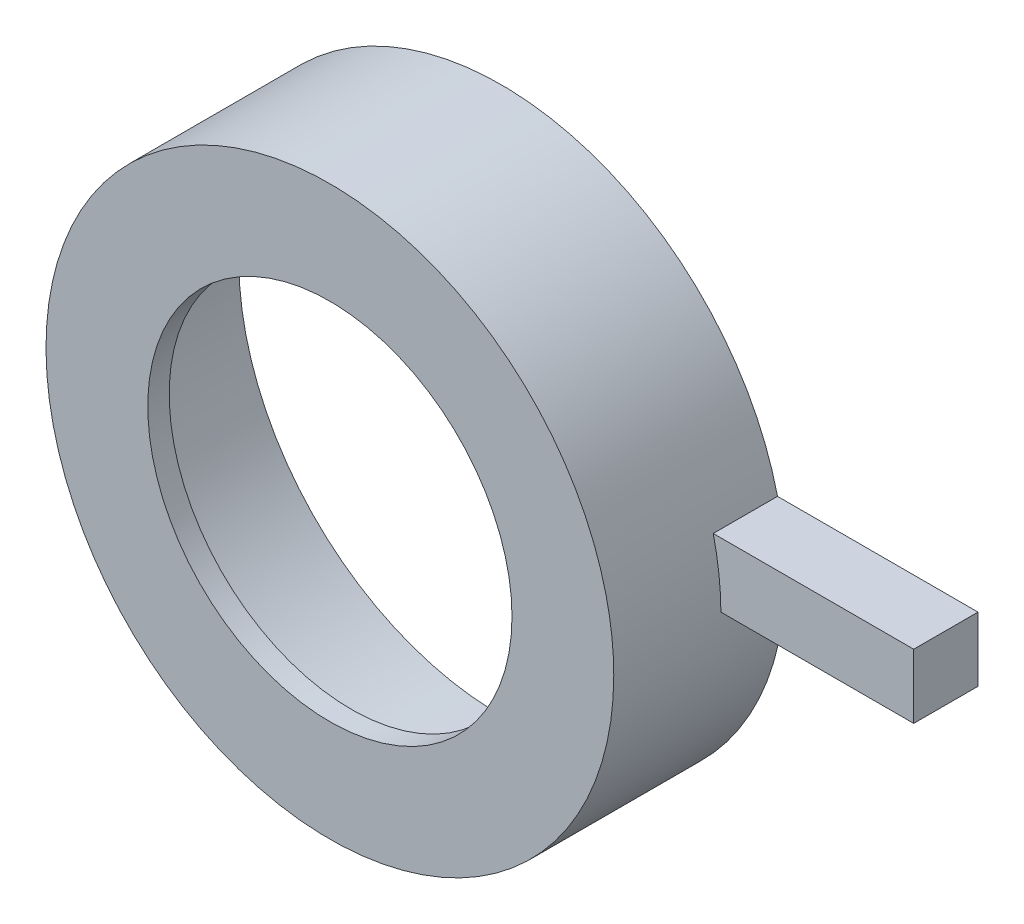
ISO-10303-21;
HEADER;
FILE_DESCRIPTION(('STEP AP214'),'2;1');
FILE_NAME('part.step','',(''),(''),'','','');
FILE_SCHEMA(('AUTOMOTIVE_DESIGN { 1 0 10303 214 1 1 1 1 }'));
ENDSEC;
DATA;
#1=APPLICATION_CONTEXT('core data for automotive mechanical design processes');
#2=APPLICATION_PROTOCOL_DEFINITION('international standard','automotive_design',2000,#1);
#3=PRODUCT_CONTEXT('',#1,'mechanical');
#4=PRODUCT('Part','Part','',(#3));
#5=PRODUCT_RELATED_PRODUCT_CATEGORY('part','',(#4));
#6=PRODUCT_DEFINITION_FORMATION('','',#4);
#7=PRODUCT_DEFINITION_CONTEXT('part definition',#1,'design');
#8=PRODUCT_DEFINITION('design','',#6,#7);
#9=PRODUCT_DEFINITION_SHAPE('','',#8);
#10=(LENGTH_UNIT() NAMED_UNIT(*) SI_UNIT(.MILLI.,.METRE.));
#11=(NAMED_UNIT(*) PLANE_ANGLE_UNIT() SI_UNIT($,.RADIAN.));
#12=(NAMED_UNIT(*) SI_UNIT($,.STERADIAN.) SOLID_ANGLE_UNIT());
#13=UNCERTAINTY_MEASURE_WITH_UNIT(LENGTH_MEASURE(1.E-05),#10,'distance_accuracy_value','');
#14=(GEOMETRIC_REPRESENTATION_CONTEXT(3) GLOBAL_UNCERTAINTY_ASSIGNED_CONTEXT((#13)) GLOBAL_UNIT_ASSIGNED_CONTEXT((#10,
#11,#12)) REPRESENTATION_CONTEXT('',''));
#15=CARTESIAN_POINT('',(0.,0.,0.));
#16=DIRECTION('',(0.,0.,1.));
#17=DIRECTION('',(1.,0.,0.));
#18=AXIS2_PLACEMENT_3D('',#15,#16,#17);
#19=CARTESIAN_POINT('',(0.,0.,7.));
#20=DIRECTION('',(0.,0.,-1.));
#21=DIRECTION('',(-1.,0.,0.));
#22=AXIS2_PLACEMENT_3D('',#19,#20,#21);
#23=CYLINDRICAL_SURFACE('',#22,13.25);
#24=CARTESIAN_POINT('',(0.,0.,8.));
#25=DIRECTION('',(0.,0.,1.));
#26=DIRECTION('',(1.,0.,0.));
#27=AXIS2_PLACEMENT_3D('',#24,#25,#26);
#28=CIRCLE('',#27,13.25);
#29=CARTESIAN_POINT('',(13.25,0.,8.));
#30=VERTEX_POINT('',#29);
#31=EDGE_CURVE('E103',#30,#30,#28,.T.);
#32=ORIENTED_EDGE('',*,*,#31,.F.);
#33=EDGE_LOOP('',(#32));
#34=FACE_BOUND('',#33,.T.);
#35=DIRECTION('',(0.,0.,-1.));
#36=VECTOR('',#35,1.);
#37=CARTESIAN_POINT('',(13.249877949999,0.0568709955148282,7.));
#38=LINE('',#37,#36);
#39=CARTESIAN_POINT('',(13.249877949999,0.0568709955148282,3.));
#40=VERTEX_POINT('',#39);
#41=CARTESIAN_POINT('',(13.249877949999,0.0568709955148282,0.));
#42=VERTEX_POINT('',#41);
#43=EDGE_CURVE('E11',#40,#42,#38,.T.);
#44=ORIENTED_EDGE('',*,*,#43,.F.);
#45=CARTESIAN_POINT('',(0.,0.,3.));
#46=DIRECTION('',(0.,0.,1.));
#47=DIRECTION('',(1.,0.,0.));
#48=AXIS2_PLACEMENT_3D('',#45,#46,#47);
#49=CIRCLE('',#48,13.25);
#50=CARTESIAN_POINT('',(12.892557532033,3.05687099551483,3.));
#51=VERTEX_POINT('',#50);
#52=EDGE_CURVE('E45',#40,#51,#49,.T.);
#53=ORIENTED_EDGE('',*,*,#52,.T.);
#54=DIRECTION('',(0.,0.,-1.));
#55=VECTOR('',#54,1.);
#56=CARTESIAN_POINT('',(12.892557532033,3.05687099551483,7.));
#57=LINE('',#56,#55);
#58=CARTESIAN_POINT('',(12.892557532033,3.05687099551483,0.));
#59=VERTEX_POINT('',#58);
#60=EDGE_CURVE('E38',#59,#51,#57,.F.);
#61=ORIENTED_EDGE('',*,*,#60,.F.);
#62=CARTESIAN_POINT('',(0.,0.,0.));
#63=DIRECTION('',(0.,0.,1.));
#64=DIRECTION('',(1.,0.,0.));
#65=AXIS2_PLACEMENT_3D('',#62,#63,#64);
#66=CIRCLE('',#65,13.25);
#67=EDGE_CURVE('E114',#59,#42,#66,.T.);
#68=ORIENTED_EDGE('',*,*,#67,.T.);
#69=EDGE_LOOP('',(#44,#53,#61,#68));
#70=FACE_BOUND('',#69,.T.);
#71=ADVANCED_FACE('F31',(#34,#70),#23,.T.);
#72=CARTESIAN_POINT('',(0.,0.,0.));
#73=DIRECTION('',(0.,0.,1.));
#74=DIRECTION('',(1.,0.,0.));
#75=AXIS2_PLACEMENT_3D('',#72,#73,#74);
#76=PLANE('',#75);
#77=DIRECTION('',(1.,0.,0.));
#78=VECTOR('',#77,1.);
#79=CARTESIAN_POINT('',(12.25,0.0568709955148282,0.));
#80=LINE('',#79,#78);
#81=CARTESIAN_POINT('',(22.25,0.0568709955148282,0.));
#82=VERTEX_POINT('',#81);
#83=EDGE_CURVE('E81',#42,#82,#80,.T.);
#84=ORIENTED_EDGE('',*,*,#83,.F.);
#85=ORIENTED_EDGE('',*,*,#67,.F.);
#86=DIRECTION('',(-1.,0.,0.));
#87=VECTOR('',#86,1.);
#88=CARTESIAN_POINT('',(12.25,3.05687099551483,0.));
#89=LINE('',#88,#87);
#90=CARTESIAN_POINT('',(22.25,3.05687099551483,0.));
#91=VERTEX_POINT('',#90);
#92=EDGE_CURVE('E75',#91,#59,#89,.T.);
#93=ORIENTED_EDGE('',*,*,#92,.F.);
#94=DIRECTION('',(0.,1.,0.));
#95=VECTOR('',#94,1.);
#96=CARTESIAN_POINT('',(22.25,3.05687099551483,0.));
#97=LINE('',#96,#95);
#98=EDGE_CURVE('E95',#82,#91,#97,.T.);
#99=ORIENTED_EDGE('',*,*,#98,.F.);
#100=EDGE_LOOP('',(#84,#85,#93,#99));
#101=FACE_BOUND('',#100,.T.);
#102=CARTESIAN_POINT('',(0.,0.,0.));
#103=DIRECTION('',(0.,0.,1.));
#104=DIRECTION('',(1.,0.,0.));
#105=AXIS2_PLACEMENT_3D('',#102,#103,#104);
#106=CIRCLE('',#105,12.25);
#107=CARTESIAN_POINT('',(12.25,0.,0.));
#108=VERTEX_POINT('',#107);
#109=EDGE_CURVE('E111',#108,#108,#106,.T.);
#110=ORIENTED_EDGE('',*,*,#109,.T.);
#111=EDGE_LOOP('',(#110));
#112=FACE_BOUND('',#111,.T.);
#113=ADVANCED_FACE('F120',(#101,#112),#76,.F.);
#114=CARTESIAN_POINT('',(0.,0.,7.));
#115=DIRECTION('',(0.,0.,-1.));
#116=DIRECTION('',(-1.,0.,0.));
#117=AXIS2_PLACEMENT_3D('',#114,#115,#116);
#118=CYLINDRICAL_SURFACE('',#117,12.25);
#119=CARTESIAN_POINT('',(0.,0.,7.));
#120=DIRECTION('',(0.,0.,1.));
#121=DIRECTION('',(1.,0.,0.));
#122=AXIS2_PLACEMENT_3D('',#119,#120,#121);
#123=CIRCLE('',#122,12.25);
#124=CARTESIAN_POINT('',(12.25,0.,7.));
#125=VERTEX_POINT('',#124);
#126=EDGE_CURVE('E108',#125,#125,#123,.T.);
#127=ORIENTED_EDGE('',*,*,#126,.T.);
#128=EDGE_LOOP('',(#127));
#129=FACE_BOUND('',#128,.T.);
#130=ORIENTED_EDGE('',*,*,#109,.F.);
#131=EDGE_LOOP('',(#130));
#132=FACE_BOUND('',#131,.T.);
#133=ADVANCED_FACE('F123',(#129,#132),#118,.F.);
#134=CARTESIAN_POINT('',(0.,0.,8.));
#135=DIRECTION('',(0.,0.,1.));
#136=DIRECTION('',(1.,0.,0.));
#137=AXIS2_PLACEMENT_3D('',#134,#135,#136);
#138=PLANE('',#137);
#139=ORIENTED_EDGE('',*,*,#31,.T.);
#140=EDGE_LOOP('',(#139));
#141=FACE_BOUND('',#140,.T.);
#142=CARTESIAN_POINT('',(0.,0.,8.));
#143=DIRECTION('',(0.,0.,1.));
#144=DIRECTION('',(1.,0.,0.));
#145=AXIS2_PLACEMENT_3D('',#142,#143,#144);
#146=CIRCLE('',#145,8.5);
#147=CARTESIAN_POINT('',(8.5,0.,8.));
#148=VERTEX_POINT('',#147);
#149=EDGE_CURVE('E100',#148,#148,#146,.T.);
#150=ORIENTED_EDGE('',*,*,#149,.F.);
#151=EDGE_LOOP('',(#150));
#152=FACE_BOUND('',#151,.T.);
#153=ADVANCED_FACE('F127',(#141,#152),#138,.T.);
#154=CARTESIAN_POINT('',(0.,0.,7.));
#155=DIRECTION('',(0.,0.,1.));
#156=DIRECTION('',(1.,0.,0.));
#157=AXIS2_PLACEMENT_3D('',#154,#155,#156);
#158=PLANE('',#157);
#159=ORIENTED_EDGE('',*,*,#126,.F.);
#160=EDGE_LOOP('',(#159));
#161=FACE_BOUND('',#160,.T.);
#162=CARTESIAN_POINT('',(0.,0.,7.));
#163=DIRECTION('',(0.,0.,1.));
#164=DIRECTION('',(1.,0.,0.));
#165=AXIS2_PLACEMENT_3D('',#162,#163,#164);
#166=CIRCLE('',#165,8.5);
#167=CARTESIAN_POINT('',(8.5,0.,7.));
#168=VERTEX_POINT('',#167);
#169=EDGE_CURVE('E84',#168,#168,#166,.T.);
#170=ORIENTED_EDGE('',*,*,#169,.T.);
#171=EDGE_LOOP('',(#170));
#172=FACE_BOUND('',#171,.T.);
#173=ADVANCED_FACE('F133',(#161,#172),#158,.F.);
#174=CARTESIAN_POINT('',(0.,0.,8.));
#175=DIRECTION('',(0.,0.,-1.));
#176=DIRECTION('',(-1.,0.,0.));
#177=AXIS2_PLACEMENT_3D('',#174,#175,#176);
#178=CYLINDRICAL_SURFACE('',#177,8.5);
#179=ORIENTED_EDGE('',*,*,#149,.T.);
#180=EDGE_LOOP('',(#179));
#181=FACE_BOUND('',#180,.T.);
#182=ORIENTED_EDGE('',*,*,#169,.F.);
#183=EDGE_LOOP('',(#182));
#184=FACE_BOUND('',#183,.T.);
#185=ADVANCED_FACE('F145',(#181,#184),#178,.F.);
#186=CARTESIAN_POINT('',(12.25,0.0568709955148282,3.));
#187=DIRECTION('',(0.,1.,0.));
#188=DIRECTION('',(0.,0.,1.));
#189=AXIS2_PLACEMENT_3D('',#186,#187,#188);
#190=PLANE('',#189);
#191=DIRECTION('',(1.,0.,0.));
#192=VECTOR('',#191,1.);
#193=CARTESIAN_POINT('',(12.25,0.0568709955148282,3.));
#194=LINE('',#193,#192);
#195=CARTESIAN_POINT('',(22.25,0.0568709955148282,3.));
#196=VERTEX_POINT('',#195);
#197=EDGE_CURVE('E67',#40,#196,#194,.T.);
#198=ORIENTED_EDGE('',*,*,#197,.F.);
#199=ORIENTED_EDGE('',*,*,#43,.T.);
#200=ORIENTED_EDGE('',*,*,#83,.T.);
#201=DIRECTION('',(0.,0.,-1.));
#202=VECTOR('',#201,1.);
#203=CARTESIAN_POINT('',(22.25,0.0568709955148282,3.));
#204=LINE('',#203,#202);
#205=EDGE_CURVE('E78',#196,#82,#204,.T.);
#206=ORIENTED_EDGE('',*,*,#205,.F.);
#207=EDGE_LOOP('',(#198,#199,#200,#206));
#208=FACE_BOUND('',#207,.T.);
#209=ADVANCED_FACE('F79',(#208),#190,.F.);
#210=CARTESIAN_POINT('',(12.25,3.05687099551483,3.));
#211=DIRECTION('',(0.,-1.,0.));
#212=DIRECTION('',(0.,0.,-1.));
#213=AXIS2_PLACEMENT_3D('',#210,#211,#212);
#214=PLANE('',#213);
#215=ORIENTED_EDGE('',*,*,#92,.T.);
#216=ORIENTED_EDGE('',*,*,#60,.T.);
#217=DIRECTION('',(-1.,0.,0.));
#218=VECTOR('',#217,1.);
#219=CARTESIAN_POINT('',(12.25,3.05687099551483,3.));
#220=LINE('',#219,#218);
#221=CARTESIAN_POINT('',(22.25,3.05687099551483,3.));
#222=VERTEX_POINT('',#221);
#223=EDGE_CURVE('E90',#222,#51,#220,.T.);
#224=ORIENTED_EDGE('',*,*,#223,.F.);
#225=DIRECTION('',(0.,0.,-1.));
#226=VECTOR('',#225,1.);
#227=CARTESIAN_POINT('',(22.25,3.05687099551483,3.));
#228=LINE('',#227,#226);
#229=EDGE_CURVE('E85',#222,#91,#228,.T.);
#230=ORIENTED_EDGE('',*,*,#229,.T.);
#231=EDGE_LOOP('',(#215,#216,#224,#230));
#232=FACE_BOUND('',#231,.T.);
#233=ADVANCED_FACE('F117',(#232),#214,.F.);
#234=CARTESIAN_POINT('',(12.25,0.0568709955148282,3.));
#235=DIRECTION('',(0.,0.,1.));
#236=DIRECTION('',(1.,0.,0.));
#237=AXIS2_PLACEMENT_3D('',#234,#235,#236);
#238=PLANE('',#237);
#239=ORIENTED_EDGE('',*,*,#52,.F.);
#240=ORIENTED_EDGE('',*,*,#197,.T.);
#241=DIRECTION('',(0.,1.,0.));
#242=VECTOR('',#241,1.);
#243=CARTESIAN_POINT('',(22.25,3.05687099551483,3.));
#244=LINE('',#243,#242);
#245=EDGE_CURVE('E72',#196,#222,#244,.T.);
#246=ORIENTED_EDGE('',*,*,#245,.T.);
#247=ORIENTED_EDGE('',*,*,#223,.T.);
#248=EDGE_LOOP('',(#239,#240,#246,#247));
#249=FACE_BOUND('',#248,.T.);
#250=ADVANCED_FACE('F69',(#249),#238,.T.);
#251=CARTESIAN_POINT('',(22.25,3.05687099551483,3.));
#252=DIRECTION('',(-1.,0.,0.));
#253=DIRECTION('',(0.,0.,1.));
#254=AXIS2_PLACEMENT_3D('',#251,#252,#253);
#255=PLANE('',#254);
#256=ORIENTED_EDGE('',*,*,#98,.T.);
#257=ORIENTED_EDGE('',*,*,#229,.F.);
#258=ORIENTED_EDGE('',*,*,#245,.F.);
#259=ORIENTED_EDGE('',*,*,#205,.T.);
#260=EDGE_LOOP('',(#256,#257,#258,#259));
#261=FACE_BOUND('',#260,.T.);
#262=ADVANCED_FACE('F87',(#261),#255,.F.);
#263=CLOSED_SHELL('',(#71,#113,#133,#153,#173,#185,#209,#233,#250,#262));
#264=MANIFOLD_SOLID_BREP('B2',#263);
#265=ADVANCED_BREP_SHAPE_REPRESENTATION('',(#18,#264),#14);
#266=SHAPE_DEFINITION_REPRESENTATION(#9,#265);
ENDSEC;
END-ISO-10303-21;
